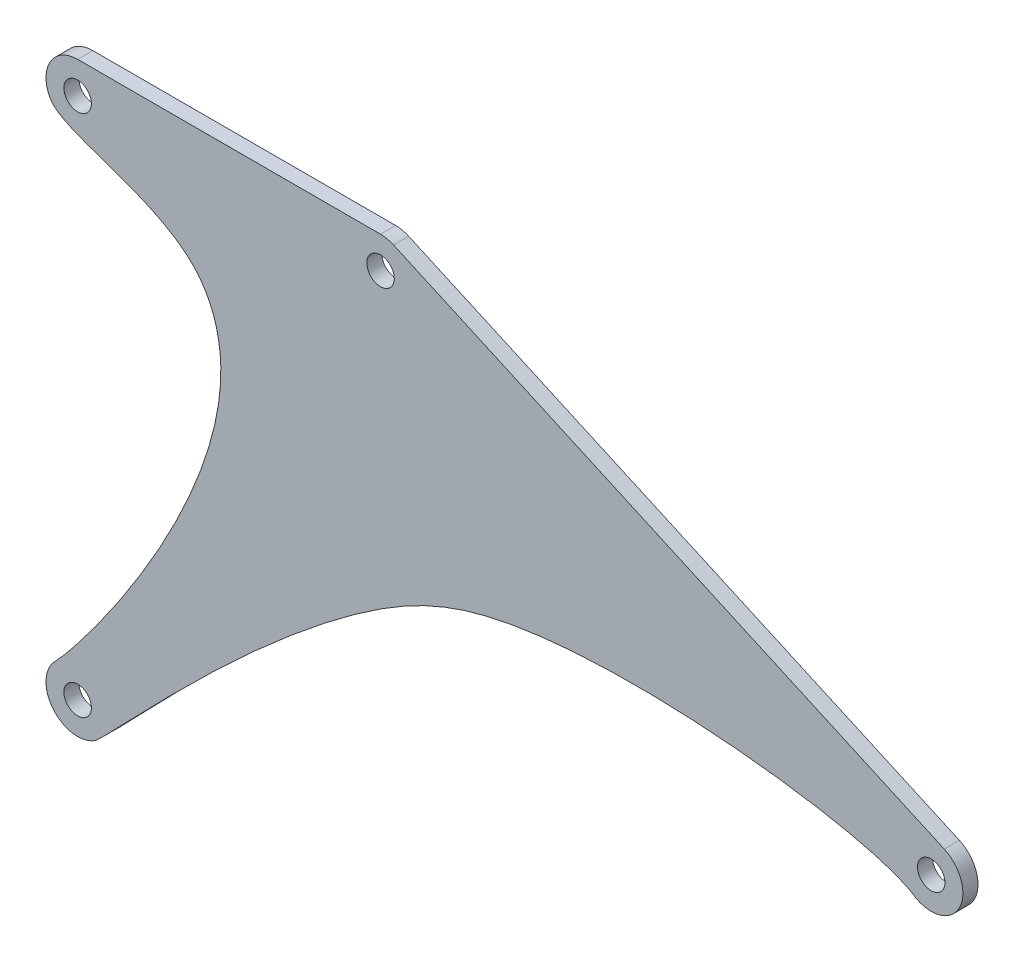
ISO-10303-21;
HEADER;
FILE_DESCRIPTION(('STEP AP214'),'2;1');
FILE_NAME('part.step','',(''),(''),'','','');
FILE_SCHEMA(('AUTOMOTIVE_DESIGN { 1 0 10303 214 1 1 1 1 }'));
ENDSEC;
DATA;
#1=APPLICATION_CONTEXT('core data for automotive mechanical design processes');
#2=APPLICATION_PROTOCOL_DEFINITION('international standard','automotive_design',2000,#1);
#3=PRODUCT_CONTEXT('',#1,'mechanical');
#4=PRODUCT('Part','Part','',(#3));
#5=PRODUCT_RELATED_PRODUCT_CATEGORY('part','',(#4));
#6=PRODUCT_DEFINITION_FORMATION('','',#4);
#7=PRODUCT_DEFINITION_CONTEXT('part definition',#1,'design');
#8=PRODUCT_DEFINITION('design','',#6,#7);
#9=PRODUCT_DEFINITION_SHAPE('','',#8);
#10=(LENGTH_UNIT() NAMED_UNIT(*) SI_UNIT(.MILLI.,.METRE.));
#11=(NAMED_UNIT(*) PLANE_ANGLE_UNIT() SI_UNIT($,.RADIAN.));
#12=(NAMED_UNIT(*) SI_UNIT($,.STERADIAN.) SOLID_ANGLE_UNIT());
#13=UNCERTAINTY_MEASURE_WITH_UNIT(LENGTH_MEASURE(1.E-05),#10,'distance_accuracy_value','');
#14=(GEOMETRIC_REPRESENTATION_CONTEXT(3) GLOBAL_UNCERTAINTY_ASSIGNED_CONTEXT((#13)) GLOBAL_UNIT_ASSIGNED_CONTEXT((#10,
#11,#12)) REPRESENTATION_CONTEXT('',''));
#15=CARTESIAN_POINT('',(0.,0.,0.));
#16=DIRECTION('',(0.,0.,1.));
#17=DIRECTION('',(1.,0.,0.));
#18=AXIS2_PLACEMENT_3D('',#15,#16,#17);
#19=CARTESIAN_POINT('',(-110.,0.,2.75));
#20=DIRECTION('',(0.,0.,1.));
#21=DIRECTION('',(1.,0.,0.));
#22=AXIS2_PLACEMENT_3D('',#19,#20,#21);
#23=PLANE('',#22);
#24=CARTESIAN_POINT('',(200.,-90.,2.75));
#25=DIRECTION('',(0.,0.,1.));
#26=DIRECTION('',(1.,0.,0.));
#27=AXIS2_PLACEMENT_3D('',#24,#25,#26);
#28=CIRCLE('',#27,4.99999999999999);
#29=CARTESIAN_POINT('',(205.,-90.,2.75));
#30=VERTEX_POINT('',#29);
#31=EDGE_CURVE('E252',#30,#30,#28,.T.);
#32=ORIENTED_EDGE('',*,*,#31,.F.);
#33=EDGE_LOOP('',(#32));
#34=FACE_BOUND('',#33,.T.);
#35=CARTESIAN_POINT('',(0.,0.,2.75));
#36=DIRECTION('',(0.,0.,1.));
#37=DIRECTION('',(1.,0.,0.));
#38=AXIS2_PLACEMENT_3D('',#35,#36,#37);
#39=CIRCLE('',#38,5.);
#40=CARTESIAN_POINT('',(5.,0.,2.75));
#41=VERTEX_POINT('',#40);
#42=EDGE_CURVE('E148',#41,#41,#39,.T.);
#43=ORIENTED_EDGE('',*,*,#42,.F.);
#44=EDGE_LOOP('',(#43));
#45=FACE_BOUND('',#44,.T.);
#46=CARTESIAN_POINT('',(-110.,0.,2.75));
#47=DIRECTION('',(0.,0.,1.));
#48=DIRECTION('',(1.,0.,0.));
#49=AXIS2_PLACEMENT_3D('',#46,#47,#48);
#50=CIRCLE('',#49,11.5);
#51=CARTESIAN_POINT('',(-110.,11.5,2.75));
#52=VERTEX_POINT('',#51);
#53=CARTESIAN_POINT('',(-119.914835658129,-5.82632249985345,2.75));
#54=VERTEX_POINT('',#53);
#55=EDGE_CURVE('E176',#52,#54,#50,.T.);
#56=ORIENTED_EDGE('',*,*,#55,.T.);
#57=CARTESIAN_POINT('',(-119.914835658129,-5.82632249985345,2.75));
#58=CARTESIAN_POINT('',(-114.934982102207,-14.300695418577,2.75));
#59=CARTESIAN_POINT('',(-66.4481926678089,-18.6927538604132,2.75));
#60=CARTESIAN_POINT('',(-46.8137124412416,-89.4069391929658,2.75));
#61=CARTESIAN_POINT('',(-106.083618348045,-169.412013562371,2.75));
#62=CARTESIAN_POINT('',(-118.265297035189,-182.004071978807,2.75));
#63=B_SPLINE_CURVE_WITH_KNOTS('',3,(#57,#58,#59,#60,#61,#62),.UNSPECIFIED.,.F.,.F.,(4,1,1,4),
(0.,0.300298834397677,0.455611494059043,1.),.UNSPECIFIED.);
#64=CARTESIAN_POINT('',(-118.265297035189,-182.004071978807,2.75));
#65=VERTEX_POINT('',#64);
#66=EDGE_CURVE('E102',#54,#65,#63,.T.);
#67=ORIENTED_EDGE('',*,*,#66,.T.);
#68=CARTESIAN_POINT('',(-110.,-190.,2.75));
#69=DIRECTION('',(0.,0.,1.));
#70=DIRECTION('',(1.,0.,0.));
#71=AXIS2_PLACEMENT_3D('',#68,#69,#70);
#72=CIRCLE('',#71,11.5);
#73=CARTESIAN_POINT('',(-103.605175933594,-199.558045049052,2.75));
#74=VERTEX_POINT('',#73);
#75=EDGE_CURVE('E197',#65,#74,#72,.T.);
#76=ORIENTED_EDGE('',*,*,#75,.T.);
#77=CARTESIAN_POINT('',(-103.605175933594,-199.558045049052,2.75));
#78=CARTESIAN_POINT('',(-99.1666413445087,-196.588436968719,2.75));
#79=CARTESIAN_POINT('',(-37.7477671952194,-126.045876693086,2.75));
#80=CARTESIAN_POINT('',(58.8347097448599,-72.8410252905217,2.75));
#81=CARTESIAN_POINT('',(177.378760182153,-88.5291661848254,2.75));
#82=CARTESIAN_POINT('',(193.535322948844,-99.51093847232,2.75));
#83=B_SPLINE_CURVE_WITH_KNOTS('',3,(#77,#78,#79,#80,#81,#82),.UNSPECIFIED.,.F.,.F.,(4,1,1,4),
(0.,0.472274195572171,0.598362620149341,1.),.UNSPECIFIED.);
#84=CARTESIAN_POINT('',(193.535322948844,-99.5109384723199,2.75));
#85=VERTEX_POINT('',#84);
#86=EDGE_CURVE('E211',#74,#85,#83,.T.);
#87=ORIENTED_EDGE('',*,*,#86,.T.);
#88=CARTESIAN_POINT('',(200.,-90.,2.75));
#89=DIRECTION('',(0.,0.,1.));
#90=DIRECTION('',(1.,0.,0.));
#91=AXIS2_PLACEMENT_3D('',#88,#89,#90);
#92=CIRCLE('',#91,11.5);
#93=CARTESIAN_POINT('',(204.719193789281,-79.5129026904863,2.75));
#94=VERTEX_POINT('',#93);
#95=EDGE_CURVE('E121',#85,#94,#92,.T.);
#96=ORIENTED_EDGE('',*,*,#95,.T.);
#97=DIRECTION('',(-0.911921505175107,0.410364677328798,0.));
#98=VECTOR('',#97,1.);
#99=CARTESIAN_POINT('',(4.71919378928117,10.4870973095137,2.75));
#100=LINE('',#99,#98);
#101=CARTESIAN_POINT('',(4.71919378928117,10.4870973095137,2.75));
#102=VERTEX_POINT('',#101);
#103=EDGE_CURVE('E115',#94,#102,#100,.T.);
#104=ORIENTED_EDGE('',*,*,#103,.T.);
#105=CARTESIAN_POINT('',(0.,0.,2.75));
#106=DIRECTION('',(0.,0.,1.));
#107=DIRECTION('',(1.,0.,0.));
#108=AXIS2_PLACEMENT_3D('',#105,#106,#107);
#109=CIRCLE('',#108,11.5);
#110=CARTESIAN_POINT('',(0.,11.5,2.75));
#111=VERTEX_POINT('',#110);
#112=EDGE_CURVE('E119',#102,#111,#109,.T.);
#113=ORIENTED_EDGE('',*,*,#112,.T.);
#114=DIRECTION('',(-1.,0.,0.));
#115=VECTOR('',#114,1.);
#116=CARTESIAN_POINT('',(-110.,11.5,2.75));
#117=LINE('',#116,#115);
#118=EDGE_CURVE('E59',#111,#52,#117,.T.);
#119=ORIENTED_EDGE('',*,*,#118,.T.);
#120=EDGE_LOOP('',(#56,#67,#76,#87,#96,#104,#113,#119));
#121=FACE_BOUND('',#120,.T.);
#122=CARTESIAN_POINT('',(-110.,0.,2.75));
#123=DIRECTION('',(0.,0.,1.));
#124=DIRECTION('',(1.,0.,0.));
#125=AXIS2_PLACEMENT_3D('',#122,#123,#124);
#126=CIRCLE('',#125,5.);
#127=CARTESIAN_POINT('',(-105.,0.,2.75));
#128=VERTEX_POINT('',#127);
#129=EDGE_CURVE('E244',#128,#128,#126,.T.);
#130=ORIENTED_EDGE('',*,*,#129,.F.);
#131=EDGE_LOOP('',(#130));
#132=FACE_BOUND('',#131,.T.);
#133=CARTESIAN_POINT('',(-110.,-190.,2.75));
#134=DIRECTION('',(0.,0.,1.));
#135=DIRECTION('',(1.,0.,0.));
#136=AXIS2_PLACEMENT_3D('',#133,#134,#135);
#137=CIRCLE('',#136,5.00000000000001);
#138=CARTESIAN_POINT('',(-105.,-190.,2.75));
#139=VERTEX_POINT('',#138);
#140=EDGE_CURVE('E260',#139,#139,#137,.T.);
#141=ORIENTED_EDGE('',*,*,#140,.F.);
#142=EDGE_LOOP('',(#141));
#143=FACE_BOUND('',#142,.T.);
#144=ADVANCED_FACE('F41',(#34,#45,#121,#132,#143),#23,.T.);
#145=CARTESIAN_POINT('',(-110.,0.,-2.75));
#146=DIRECTION('',(0.,0.,1.));
#147=DIRECTION('',(1.,0.,0.));
#148=AXIS2_PLACEMENT_3D('',#145,#146,#147);
#149=PLANE('',#148);
#150=CARTESIAN_POINT('',(-110.,0.,-2.75));
#151=DIRECTION('',(0.,0.,1.));
#152=DIRECTION('',(1.,0.,0.));
#153=AXIS2_PLACEMENT_3D('',#150,#151,#152);
#154=CIRCLE('',#153,11.5);
#155=CARTESIAN_POINT('',(-110.,11.5,-2.75));
#156=VERTEX_POINT('',#155);
#157=CARTESIAN_POINT('',(-119.914835658129,-5.82632249985345,-2.75));
#158=VERTEX_POINT('',#157);
#159=EDGE_CURVE('E143',#156,#158,#154,.T.);
#160=ORIENTED_EDGE('',*,*,#159,.F.);
#161=DIRECTION('',(-1.,0.,0.));
#162=VECTOR('',#161,1.);
#163=CARTESIAN_POINT('',(-110.,11.5,-2.75));
#164=LINE('',#163,#162);
#165=CARTESIAN_POINT('',(0.,11.5,-2.75));
#166=VERTEX_POINT('',#165);
#167=EDGE_CURVE('E94',#166,#156,#164,.T.);
#168=ORIENTED_EDGE('',*,*,#167,.F.);
#169=CARTESIAN_POINT('',(0.,0.,-2.75));
#170=DIRECTION('',(0.,0.,1.));
#171=DIRECTION('',(1.,0.,0.));
#172=AXIS2_PLACEMENT_3D('',#169,#170,#171);
#173=CIRCLE('',#172,11.5);
#174=CARTESIAN_POINT('',(4.71919378928117,10.4870973095137,-2.75));
#175=VERTEX_POINT('',#174);
#176=EDGE_CURVE('E88',#175,#166,#173,.T.);
#177=ORIENTED_EDGE('',*,*,#176,.F.);
#178=DIRECTION('',(-0.911921505175107,0.410364677328798,0.));
#179=VECTOR('',#178,1.);
#180=CARTESIAN_POINT('',(4.71919378928117,10.4870973095137,-2.75));
#181=LINE('',#180,#179);
#182=CARTESIAN_POINT('',(204.719193789281,-79.5129026904863,-2.75));
#183=VERTEX_POINT('',#182);
#184=EDGE_CURVE('E130',#183,#175,#181,.T.);
#185=ORIENTED_EDGE('',*,*,#184,.F.);
#186=CARTESIAN_POINT('',(200.,-90.,-2.75));
#187=DIRECTION('',(0.,0.,1.));
#188=DIRECTION('',(1.,0.,0.));
#189=AXIS2_PLACEMENT_3D('',#186,#187,#188);
#190=CIRCLE('',#189,11.5);
#191=CARTESIAN_POINT('',(193.535322948844,-99.5109384723199,-2.75));
#192=VERTEX_POINT('',#191);
#193=EDGE_CURVE('E164',#192,#183,#190,.T.);
#194=ORIENTED_EDGE('',*,*,#193,.F.);
#195=CARTESIAN_POINT('',(-103.605175933594,-199.558045049052,-2.75));
#196=CARTESIAN_POINT('',(-99.1666413445087,-196.588436968719,-2.75));
#197=CARTESIAN_POINT('',(-37.7477671952194,-126.045876693086,-2.75));
#198=CARTESIAN_POINT('',(58.8347097448599,-72.8410252905217,-2.75));
#199=CARTESIAN_POINT('',(177.378760182153,-88.5291661848254,-2.75));
#200=CARTESIAN_POINT('',(193.535322948844,-99.51093847232,-2.75));
#201=B_SPLINE_CURVE_WITH_KNOTS('',3,(#195,#196,#197,#198,#199,#200),.UNSPECIFIED.,.F.,.F.,(4,1,
1,4),(0.,0.472274195572171,0.598362620149341,1.),.UNSPECIFIED.);
#202=CARTESIAN_POINT('',(-103.605175933594,-199.558045049052,-2.75));
#203=VERTEX_POINT('',#202);
#204=EDGE_CURVE('E159',#203,#192,#201,.T.);
#205=ORIENTED_EDGE('',*,*,#204,.F.);
#206=CARTESIAN_POINT('',(-110.,-190.,-2.75));
#207=DIRECTION('',(0.,0.,1.));
#208=DIRECTION('',(1.,0.,0.));
#209=AXIS2_PLACEMENT_3D('',#206,#207,#208);
#210=CIRCLE('',#209,11.5);
#211=CARTESIAN_POINT('',(-118.265297035189,-182.004071978807,-2.75));
#212=VERTEX_POINT('',#211);
#213=EDGE_CURVE('E153',#212,#203,#210,.T.);
#214=ORIENTED_EDGE('',*,*,#213,.F.);
#215=CARTESIAN_POINT('',(-119.914835658129,-5.82632249985345,-2.75));
#216=CARTESIAN_POINT('',(-114.934982102207,-14.300695418577,-2.75));
#217=CARTESIAN_POINT('',(-66.4481926678089,-18.6927538604132,-2.75));
#218=CARTESIAN_POINT('',(-46.8137124412416,-89.4069391929658,-2.75));
#219=CARTESIAN_POINT('',(-106.083618348045,-169.412013562371,-2.75));
#220=CARTESIAN_POINT('',(-118.265297035189,-182.004071978807,-2.75));
#221=B_SPLINE_CURVE_WITH_KNOTS('',3,(#215,#216,#217,#218,#219,#220),.UNSPECIFIED.,.F.,.F.,(4,1,
1,4),(0.,0.300298834397677,0.455611494059043,1.),.UNSPECIFIED.);
#222=EDGE_CURVE('E147',#158,#212,#221,.T.);
#223=ORIENTED_EDGE('',*,*,#222,.F.);
#224=EDGE_LOOP('',(#160,#168,#177,#185,#194,#205,#214,#223));
#225=FACE_BOUND('',#224,.T.);
#226=CARTESIAN_POINT('',(0.,0.,-2.75));
#227=DIRECTION('',(0.,0.,1.));
#228=DIRECTION('',(1.,0.,0.));
#229=AXIS2_PLACEMENT_3D('',#226,#227,#228);
#230=CIRCLE('',#229,5.);
#231=CARTESIAN_POINT('',(5.,0.,-2.75));
#232=VERTEX_POINT('',#231);
#233=EDGE_CURVE('E240',#232,#232,#230,.T.);
#234=ORIENTED_EDGE('',*,*,#233,.T.);
#235=EDGE_LOOP('',(#234));
#236=FACE_BOUND('',#235,.T.);
#237=CARTESIAN_POINT('',(-110.,0.,-2.75));
#238=DIRECTION('',(0.,0.,1.));
#239=DIRECTION('',(1.,0.,0.));
#240=AXIS2_PLACEMENT_3D('',#237,#238,#239);
#241=CIRCLE('',#240,5.);
#242=CARTESIAN_POINT('',(-105.,0.,-2.75));
#243=VERTEX_POINT('',#242);
#244=EDGE_CURVE('E248',#243,#243,#241,.T.);
#245=ORIENTED_EDGE('',*,*,#244,.T.);
#246=EDGE_LOOP('',(#245));
#247=FACE_BOUND('',#246,.T.);
#248=CARTESIAN_POINT('',(200.,-90.,-2.75));
#249=DIRECTION('',(0.,0.,1.));
#250=DIRECTION('',(1.,0.,0.));
#251=AXIS2_PLACEMENT_3D('',#248,#249,#250);
#252=CIRCLE('',#251,4.99999999999999);
#253=CARTESIAN_POINT('',(205.,-90.,-2.75));
#254=VERTEX_POINT('',#253);
#255=EDGE_CURVE('E256',#254,#254,#252,.T.);
#256=ORIENTED_EDGE('',*,*,#255,.T.);
#257=EDGE_LOOP('',(#256));
#258=FACE_BOUND('',#257,.T.);
#259=CARTESIAN_POINT('',(-110.,-190.,-2.75));
#260=DIRECTION('',(0.,0.,1.));
#261=DIRECTION('',(1.,0.,0.));
#262=AXIS2_PLACEMENT_3D('',#259,#260,#261);
#263=CIRCLE('',#262,5.00000000000001);
#264=CARTESIAN_POINT('',(-105.,-190.,-2.75));
#265=VERTEX_POINT('',#264);
#266=EDGE_CURVE('E264',#265,#265,#263,.T.);
#267=ORIENTED_EDGE('',*,*,#266,.T.);
#268=EDGE_LOOP('',(#267));
#269=FACE_BOUND('',#268,.T.);
#270=ADVANCED_FACE('F201',(#225,#236,#247,#258,#269),#149,.F.);
#271=CARTESIAN_POINT('',(-110.,0.,2.75));
#272=DIRECTION('',(0.,0.,-1.));
#273=DIRECTION('',(-1.,0.,0.));
#274=AXIS2_PLACEMENT_3D('',#271,#272,#273);
#275=CYLINDRICAL_SURFACE('',#274,11.5);
#276=ORIENTED_EDGE('',*,*,#159,.T.);
#277=DIRECTION('',(0.,0.,-1.));
#278=VECTOR('',#277,1.);
#279=CARTESIAN_POINT('',(-119.914835658129,-5.82632249985345,2.75));
#280=LINE('',#279,#278);
#281=EDGE_CURVE('E11',#54,#158,#280,.T.);
#282=ORIENTED_EDGE('',*,*,#281,.F.);
#283=ORIENTED_EDGE('',*,*,#55,.F.);
#284=DIRECTION('',(0.,0.,-1.));
#285=VECTOR('',#284,1.);
#286=CARTESIAN_POINT('',(-110.,11.5,2.75));
#287=LINE('',#286,#285);
#288=EDGE_CURVE('E139',#52,#156,#287,.T.);
#289=ORIENTED_EDGE('',*,*,#288,.T.);
#290=EDGE_LOOP('',(#276,#282,#283,#289));
#291=FACE_BOUND('',#290,.T.);
#292=ADVANCED_FACE('F43',(#291),#275,.T.);
#293=DIRECTION('',(0.,0.,-1.));
#294=VECTOR('',#293,1.);
#295=SURFACE_OF_LINEAR_EXTRUSION('',#63,#294);
#296=ORIENTED_EDGE('',*,*,#222,.T.);
#297=DIRECTION('',(0.,0.,-1.));
#298=VECTOR('',#297,1.);
#299=CARTESIAN_POINT('',(-118.265297035189,-182.004071978807,2.75));
#300=LINE('',#299,#298);
#301=EDGE_CURVE('E51',#65,#212,#300,.T.);
#302=ORIENTED_EDGE('',*,*,#301,.F.);
#303=ORIENTED_EDGE('',*,*,#66,.F.);
#304=ORIENTED_EDGE('',*,*,#281,.T.);
#305=EDGE_LOOP('',(#296,#302,#303,#304));
#306=FACE_BOUND('',#305,.T.);
#307=ADVANCED_FACE('F228',(#306),#295,.F.);
#308=CARTESIAN_POINT('',(-110.,-190.,2.75));
#309=DIRECTION('',(0.,0.,-1.));
#310=DIRECTION('',(-1.,0.,0.));
#311=AXIS2_PLACEMENT_3D('',#308,#309,#310);
#312=CYLINDRICAL_SURFACE('',#311,11.5);
#313=ORIENTED_EDGE('',*,*,#213,.T.);
#314=DIRECTION('',(0.,0.,-1.));
#315=VECTOR('',#314,1.);
#316=CARTESIAN_POINT('',(-103.605175933594,-199.558045049052,2.75));
#317=LINE('',#316,#315);
#318=EDGE_CURVE('E187',#74,#203,#317,.T.);
#319=ORIENTED_EDGE('',*,*,#318,.F.);
#320=ORIENTED_EDGE('',*,*,#75,.F.);
#321=ORIENTED_EDGE('',*,*,#301,.T.);
#322=EDGE_LOOP('',(#313,#319,#320,#321));
#323=FACE_BOUND('',#322,.T.);
#324=ADVANCED_FACE('F195',(#323),#312,.T.);
#325=DIRECTION('',(0.,0.,-1.));
#326=VECTOR('',#325,1.);
#327=SURFACE_OF_LINEAR_EXTRUSION('',#83,#326);
#328=ORIENTED_EDGE('',*,*,#204,.T.);
#329=DIRECTION('',(0.,0.,-1.));
#330=VECTOR('',#329,1.);
#331=CARTESIAN_POINT('',(193.535322948844,-99.5109384723199,2.75));
#332=LINE('',#331,#330);
#333=EDGE_CURVE('E183',#85,#192,#332,.T.);
#334=ORIENTED_EDGE('',*,*,#333,.F.);
#335=ORIENTED_EDGE('',*,*,#86,.F.);
#336=ORIENTED_EDGE('',*,*,#318,.T.);
#337=EDGE_LOOP('',(#328,#334,#335,#336));
#338=FACE_BOUND('',#337,.T.);
#339=ADVANCED_FACE('F206',(#338),#327,.F.);
#340=CARTESIAN_POINT('',(200.,-90.,2.75));
#341=DIRECTION('',(0.,0.,-1.));
#342=DIRECTION('',(-1.,0.,0.));
#343=AXIS2_PLACEMENT_3D('',#340,#341,#342);
#344=CYLINDRICAL_SURFACE('',#343,11.5);
#345=ORIENTED_EDGE('',*,*,#193,.T.);
#346=DIRECTION('',(0.,0.,-1.));
#347=VECTOR('',#346,1.);
#348=CARTESIAN_POINT('',(204.719193789281,-79.5129026904863,2.75));
#349=LINE('',#348,#347);
#350=EDGE_CURVE('E132',#94,#183,#349,.T.);
#351=ORIENTED_EDGE('',*,*,#350,.F.);
#352=ORIENTED_EDGE('',*,*,#95,.F.);
#353=ORIENTED_EDGE('',*,*,#333,.T.);
#354=EDGE_LOOP('',(#345,#351,#352,#353));
#355=FACE_BOUND('',#354,.T.);
#356=ADVANCED_FACE('F209',(#355),#344,.T.);
#357=CARTESIAN_POINT('',(4.71919378928117,10.4870973095137,2.75));
#358=DIRECTION('',(-0.410364677328798,-0.911921505175107,0.));
#359=DIRECTION('',(0.911921505175107,-0.410364677328798,0.));
#360=AXIS2_PLACEMENT_3D('',#357,#358,#359);
#361=PLANE('',#360);
#362=ORIENTED_EDGE('',*,*,#184,.T.);
#363=DIRECTION('',(0.,0.,-1.));
#364=VECTOR('',#363,1.);
#365=CARTESIAN_POINT('',(4.71919378928117,10.4870973095137,2.75));
#366=LINE('',#365,#364);
#367=EDGE_CURVE('E127',#102,#175,#366,.T.);
#368=ORIENTED_EDGE('',*,*,#367,.F.);
#369=ORIENTED_EDGE('',*,*,#103,.F.);
#370=ORIENTED_EDGE('',*,*,#350,.T.);
#371=EDGE_LOOP('',(#362,#368,#369,#370));
#372=FACE_BOUND('',#371,.T.);
#373=ADVANCED_FACE('F128',(#372),#361,.F.);
#374=CARTESIAN_POINT('',(0.,0.,2.75));
#375=DIRECTION('',(0.,0.,-1.));
#376=DIRECTION('',(-1.,0.,0.));
#377=AXIS2_PLACEMENT_3D('',#374,#375,#376);
#378=CYLINDRICAL_SURFACE('',#377,11.5);
#379=ORIENTED_EDGE('',*,*,#176,.T.);
#380=DIRECTION('',(0.,0.,-1.));
#381=VECTOR('',#380,1.);
#382=CARTESIAN_POINT('',(0.,11.5,2.75));
#383=LINE('',#382,#381);
#384=EDGE_CURVE('E133',#111,#166,#383,.T.);
#385=ORIENTED_EDGE('',*,*,#384,.F.);
#386=ORIENTED_EDGE('',*,*,#112,.F.);
#387=ORIENTED_EDGE('',*,*,#367,.T.);
#388=EDGE_LOOP('',(#379,#385,#386,#387));
#389=FACE_BOUND('',#388,.T.);
#390=ADVANCED_FACE('F135',(#389),#378,.T.);
#391=CARTESIAN_POINT('',(-110.,11.5,2.75));
#392=DIRECTION('',(0.,-1.,0.));
#393=DIRECTION('',(1.,0.,0.));
#394=AXIS2_PLACEMENT_3D('',#391,#392,#393);
#395=PLANE('',#394);
#396=ORIENTED_EDGE('',*,*,#167,.T.);
#397=ORIENTED_EDGE('',*,*,#288,.F.);
#398=ORIENTED_EDGE('',*,*,#118,.F.);
#399=ORIENTED_EDGE('',*,*,#384,.T.);
#400=EDGE_LOOP('',(#396,#397,#398,#399));
#401=FACE_BOUND('',#400,.T.);
#402=ADVANCED_FACE('F288',(#401),#395,.F.);
#403=CARTESIAN_POINT('',(0.,0.,2.75));
#404=DIRECTION('',(0.,0.,-1.));
#405=DIRECTION('',(-1.,0.,0.));
#406=AXIS2_PLACEMENT_3D('',#403,#404,#405);
#407=CYLINDRICAL_SURFACE('',#406,5.);
#408=ORIENTED_EDGE('',*,*,#42,.T.);
#409=EDGE_LOOP('',(#408));
#410=FACE_BOUND('',#409,.T.);
#411=ORIENTED_EDGE('',*,*,#233,.F.);
#412=EDGE_LOOP('',(#411));
#413=FACE_BOUND('',#412,.T.);
#414=ADVANCED_FACE('F285',(#410,#413),#407,.F.);
#415=CARTESIAN_POINT('',(-110.,0.,2.75));
#416=DIRECTION('',(0.,0.,-1.));
#417=DIRECTION('',(-1.,0.,0.));
#418=AXIS2_PLACEMENT_3D('',#415,#416,#417);
#419=CYLINDRICAL_SURFACE('',#418,5.);
#420=ORIENTED_EDGE('',*,*,#129,.T.);
#421=EDGE_LOOP('',(#420));
#422=FACE_BOUND('',#421,.T.);
#423=ORIENTED_EDGE('',*,*,#244,.F.);
#424=EDGE_LOOP('',(#423));
#425=FACE_BOUND('',#424,.T.);
#426=ADVANCED_FACE('F358',(#422,#425),#419,.F.);
#427=CARTESIAN_POINT('',(200.,-90.,2.75));
#428=DIRECTION('',(0.,0.,-1.));
#429=DIRECTION('',(-1.,0.,0.));
#430=AXIS2_PLACEMENT_3D('',#427,#428,#429);
#431=CYLINDRICAL_SURFACE('',#430,4.99999999999999);
#432=ORIENTED_EDGE('',*,*,#31,.T.);
#433=EDGE_LOOP('',(#432));
#434=FACE_BOUND('',#433,.T.);
#435=ORIENTED_EDGE('',*,*,#255,.F.);
#436=EDGE_LOOP('',(#435));
#437=FACE_BOUND('',#436,.T.);
#438=ADVANCED_FACE('F366',(#434,#437),#431,.F.);
#439=CARTESIAN_POINT('',(-110.,-190.,2.75));
#440=DIRECTION('',(0.,0.,-1.));
#441=DIRECTION('',(-1.,0.,0.));
#442=AXIS2_PLACEMENT_3D('',#439,#440,#441);
#443=CYLINDRICAL_SURFACE('',#442,5.00000000000001);
#444=ORIENTED_EDGE('',*,*,#140,.T.);
#445=EDGE_LOOP('',(#444));
#446=FACE_BOUND('',#445,.T.);
#447=ORIENTED_EDGE('',*,*,#266,.F.);
#448=EDGE_LOOP('',(#447));
#449=FACE_BOUND('',#448,.T.);
#450=ADVANCED_FACE('F272',(#446,#449),#443,.F.);
#451=CLOSED_SHELL('',(#144,#270,#292,#307,#324,#339,#356,#373,#390,#402,#414,#426,#438,#450));
#452=MANIFOLD_SOLID_BREP('B2',#451);
#453=ADVANCED_BREP_SHAPE_REPRESENTATION('',(#18,#452),#14);
#454=SHAPE_DEFINITION_REPRESENTATION(#9,#453);
ENDSEC;
END-ISO-10303-21;
